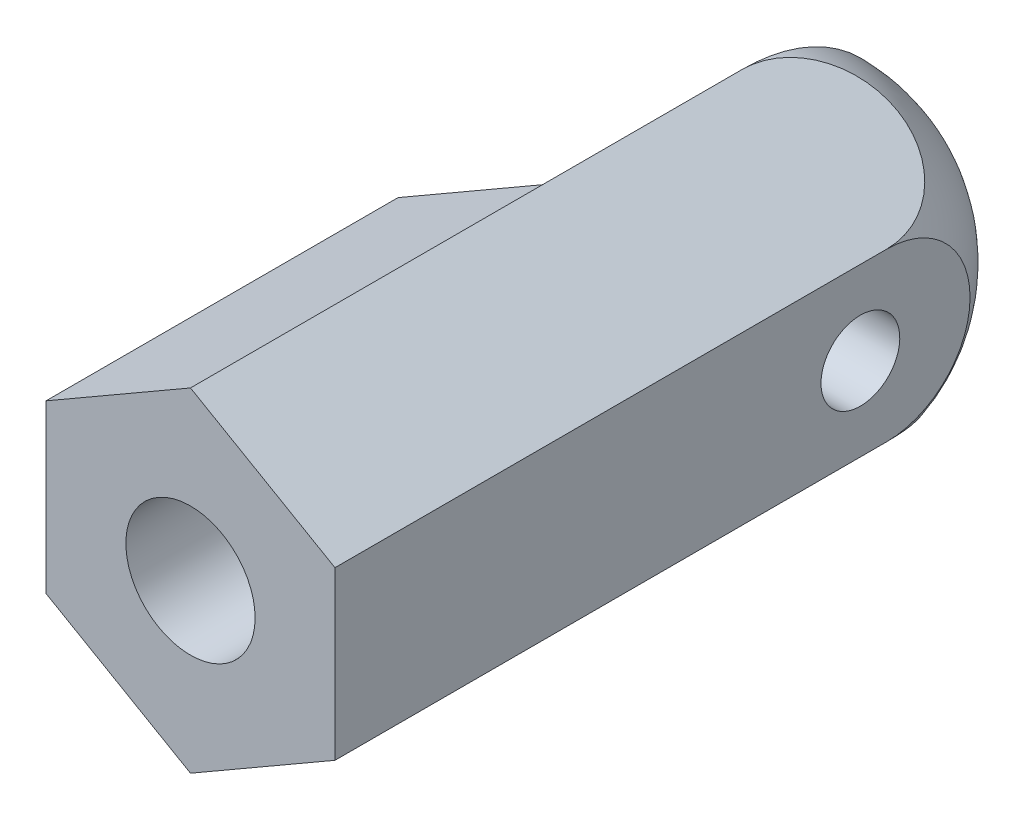
ISO-10303-21;
HEADER;
FILE_DESCRIPTION(('STEP AP214'),'2;1');
FILE_NAME('part.step','',(''),(''),'','','');
FILE_SCHEMA(('AUTOMOTIVE_DESIGN { 1 0 10303 214 1 1 1 1 }'));
ENDSEC;
DATA;
#1=APPLICATION_CONTEXT('core data for automotive mechanical design processes');
#2=APPLICATION_PROTOCOL_DEFINITION('international standard','automotive_design',2000,#1);
#3=PRODUCT_CONTEXT('',#1,'mechanical');
#4=PRODUCT('Part','Part','',(#3));
#5=PRODUCT_RELATED_PRODUCT_CATEGORY('part','',(#4));
#6=PRODUCT_DEFINITION_FORMATION('','',#4);
#7=PRODUCT_DEFINITION_CONTEXT('part definition',#1,'design');
#8=PRODUCT_DEFINITION('design','',#6,#7);
#9=PRODUCT_DEFINITION_SHAPE('','',#8);
#10=(LENGTH_UNIT() NAMED_UNIT(*) SI_UNIT(.MILLI.,.METRE.));
#11=(NAMED_UNIT(*) PLANE_ANGLE_UNIT() SI_UNIT($,.RADIAN.));
#12=(NAMED_UNIT(*) SI_UNIT($,.STERADIAN.) SOLID_ANGLE_UNIT());
#13=UNCERTAINTY_MEASURE_WITH_UNIT(LENGTH_MEASURE(1.E-05),#10,'distance_accuracy_value','');
#14=(GEOMETRIC_REPRESENTATION_CONTEXT(3) GLOBAL_UNCERTAINTY_ASSIGNED_CONTEXT((#13)) GLOBAL_UNIT_ASSIGNED_CONTEXT((#10,
#11,#12)) REPRESENTATION_CONTEXT('',''));
#15=CARTESIAN_POINT('',(0.,0.,0.));
#16=DIRECTION('',(0.,0.,1.));
#17=DIRECTION('',(1.,0.,0.));
#18=AXIS2_PLACEMENT_3D('',#15,#16,#17);
#19=CARTESIAN_POINT('',(2.75,1.58771324027147,-15.));
#20=DIRECTION('',(0.5,0.866025403784439,0.));
#21=DIRECTION('',(-0.866025403784439,0.5,0.));
#22=AXIS2_PLACEMENT_3D('',#19,#20,#21);
#23=PLANE('',#22);
#24=DIRECTION('',(0.,0.,1.));
#25=VECTOR('',#24,1.);
#26=CARTESIAN_POINT('',(2.75,1.58771324027147,-15.));
#27=LINE('',#26,#25);
#28=CARTESIAN_POINT('',(2.75,1.58771324027147,-10.5));
#29=VERTEX_POINT('',#28);
#30=CARTESIAN_POINT('',(2.75,1.58771324027147,0.));
#31=VERTEX_POINT('',#30);
#32=EDGE_CURVE('E43',#29,#31,#27,.T.);
#33=ORIENTED_EDGE('',*,*,#32,.F.);
#34=CARTESIAN_POINT('',(1.375,2.38156986040721,-10.5));
#35=DIRECTION('',(0.5,0.866025403784439,0.));
#36=DIRECTION('',(-0.866025403784439,0.5,0.));
#37=AXIS2_PLACEMENT_3D('',#34,#35,#36);
#38=CIRCLE('',#37,1.58771324027147);
#39=CARTESIAN_POINT('',(0.,3.17542648054294,-10.5));
#40=VERTEX_POINT('',#39);
#41=EDGE_CURVE('E125',#29,#40,#38,.T.);
#42=ORIENTED_EDGE('',*,*,#41,.T.);
#43=DIRECTION('',(0.,0.,1.));
#44=VECTOR('',#43,1.);
#45=CARTESIAN_POINT('',(0.,3.17542648054294,-15.));
#46=LINE('',#45,#44);
#47=CARTESIAN_POINT('',(0.,3.17542648054294,-6.7));
#48=VERTEX_POINT('',#47);
#49=EDGE_CURVE('E109',#40,#48,#46,.T.);
#50=ORIENTED_EDGE('',*,*,#49,.T.);
#51=CARTESIAN_POINT('',(0.,3.17542648054294,0.));
#52=VERTEX_POINT('',#51);
#53=EDGE_CURVE('E117',#48,#52,#46,.T.);
#54=ORIENTED_EDGE('',*,*,#53,.T.);
#55=DIRECTION('',(-0.866025403784439,0.5,0.));
#56=VECTOR('',#55,1.);
#57=CARTESIAN_POINT('',(2.75,1.58771324027147,0.));
#58=LINE('',#57,#56);
#59=EDGE_CURVE('E152',#31,#52,#58,.T.);
#60=ORIENTED_EDGE('',*,*,#59,.F.);
#61=EDGE_LOOP('',(#33,#42,#50,#54,#60));
#62=FACE_BOUND('',#61,.T.);
#63=ADVANCED_FACE('F36',(#62),#23,.T.);
#64=CARTESIAN_POINT('',(2.75,-1.58771324027147,-15.));
#65=DIRECTION('',(1.,0.,0.));
#66=DIRECTION('',(0.,1.,0.));
#67=AXIS2_PLACEMENT_3D('',#64,#65,#66);
#68=PLANE('',#67);
#69=CARTESIAN_POINT('',(2.75,0.,-10.));
#70=DIRECTION('',(1.,0.,0.));
#71=DIRECTION('',(0.,1.,0.));
#72=AXIS2_PLACEMENT_3D('',#69,#70,#71);
#73=CIRCLE('',#72,0.75);
#74=CARTESIAN_POINT('',(2.75,0.750000000000001,-10.));
#75=VERTEX_POINT('',#74);
#76=EDGE_CURVE('E137',#75,#75,#73,.T.);
#77=ORIENTED_EDGE('',*,*,#76,.F.);
#78=EDGE_LOOP('',(#77));
#79=FACE_BOUND('',#78,.T.);
#80=DIRECTION('',(0.,0.,1.));
#81=VECTOR('',#80,1.);
#82=CARTESIAN_POINT('',(2.75,-1.58771324027147,-15.));
#83=LINE('',#82,#81);
#84=CARTESIAN_POINT('',(2.75,-1.58771324027147,-10.5));
#85=VERTEX_POINT('',#84);
#86=CARTESIAN_POINT('',(2.75,-1.58771324027147,0.));
#87=VERTEX_POINT('',#86);
#88=EDGE_CURVE('E57',#85,#87,#83,.T.);
#89=ORIENTED_EDGE('',*,*,#88,.F.);
#90=CARTESIAN_POINT('',(2.75,0.,-10.5));
#91=DIRECTION('',(1.,0.,0.));
#92=DIRECTION('',(0.,1.,0.));
#93=AXIS2_PLACEMENT_3D('',#90,#91,#92);
#94=CIRCLE('',#93,1.58771324027147);
#95=EDGE_CURVE('E145',#85,#29,#94,.T.);
#96=ORIENTED_EDGE('',*,*,#95,.T.);
#97=ORIENTED_EDGE('',*,*,#32,.T.);
#98=DIRECTION('',(0.,1.,0.));
#99=VECTOR('',#98,1.);
#100=CARTESIAN_POINT('',(2.75,-1.58771324027147,0.));
#101=LINE('',#100,#99);
#102=EDGE_CURVE('E123',#87,#31,#101,.T.);
#103=ORIENTED_EDGE('',*,*,#102,.F.);
#104=EDGE_LOOP('',(#89,#96,#97,#103));
#105=FACE_BOUND('',#104,.T.);
#106=ADVANCED_FACE('F189',(#79,#105),#68,.T.);
#107=CARTESIAN_POINT('',(0.,-3.17542648054294,-15.));
#108=DIRECTION('',(0.5,-0.866025403784438,0.));
#109=DIRECTION('',(0.866025403784439,0.5,0.));
#110=AXIS2_PLACEMENT_3D('',#107,#108,#109);
#111=PLANE('',#110);
#112=DIRECTION('',(0.,0.,1.));
#113=VECTOR('',#112,1.);
#114=CARTESIAN_POINT('',(0.,-3.17542648054294,-15.));
#115=LINE('',#114,#113);
#116=CARTESIAN_POINT('',(0.,-3.17542648054294,-10.5));
#117=VERTEX_POINT('',#116);
#118=CARTESIAN_POINT('',(0.,-3.17542648054294,-6.7));
#119=VERTEX_POINT('',#118);
#120=EDGE_CURVE('E112',#117,#119,#115,.T.);
#121=ORIENTED_EDGE('',*,*,#120,.F.);
#122=CARTESIAN_POINT('',(1.375,-2.3815698604072,-10.5));
#123=DIRECTION('',(0.5,-0.866025403784438,0.));
#124=DIRECTION('',(0.866025403784439,0.5,0.));
#125=AXIS2_PLACEMENT_3D('',#122,#123,#124);
#126=CIRCLE('',#125,1.58771324027147);
#127=EDGE_CURVE('E143',#117,#85,#126,.T.);
#128=ORIENTED_EDGE('',*,*,#127,.T.);
#129=ORIENTED_EDGE('',*,*,#88,.T.);
#130=DIRECTION('',(0.866025403784439,0.5,0.));
#131=VECTOR('',#130,1.);
#132=CARTESIAN_POINT('',(0.,-3.17542648054294,0.));
#133=LINE('',#132,#131);
#134=CARTESIAN_POINT('',(0.,-3.17542648054294,0.));
#135=VERTEX_POINT('',#134);
#136=EDGE_CURVE('E163',#135,#87,#133,.T.);
#137=ORIENTED_EDGE('',*,*,#136,.F.);
#138=EDGE_CURVE('E169',#119,#135,#115,.T.);
#139=ORIENTED_EDGE('',*,*,#138,.F.);
#140=EDGE_LOOP('',(#121,#128,#129,#137,#139));
#141=FACE_BOUND('',#140,.T.);
#142=ADVANCED_FACE('F177',(#141),#111,.T.);
#143=CARTESIAN_POINT('',(-2.75,-1.58771324027147,-15.));
#144=DIRECTION('',(-0.5,-0.866025403784438,0.));
#145=DIRECTION('',(0.866025403784439,-0.5,0.));
#146=AXIS2_PLACEMENT_3D('',#143,#144,#145);
#147=PLANE('',#146);
#148=DIRECTION('',(-0.866025403784439,0.5,0.));
#149=VECTOR('',#148,1.);
#150=CARTESIAN_POINT('',(-2.75,-1.58771324027147,-6.7));
#151=LINE('',#150,#149);
#152=CARTESIAN_POINT('',(-2.75,-1.58771324027147,-6.7));
#153=VERTEX_POINT('',#152);
#154=EDGE_CURVE('E134',#119,#153,#151,.T.);
#155=ORIENTED_EDGE('',*,*,#154,.F.);
#156=ORIENTED_EDGE('',*,*,#138,.T.);
#157=DIRECTION('',(0.866025403784439,-0.5,0.));
#158=VECTOR('',#157,1.);
#159=CARTESIAN_POINT('',(-2.75,-1.58771324027147,0.));
#160=LINE('',#159,#158);
#161=CARTESIAN_POINT('',(-2.75,-1.58771324027147,0.));
#162=VERTEX_POINT('',#161);
#163=EDGE_CURVE('E160',#162,#135,#160,.T.);
#164=ORIENTED_EDGE('',*,*,#163,.F.);
#165=DIRECTION('',(0.,0.,1.));
#166=VECTOR('',#165,1.);
#167=CARTESIAN_POINT('',(-2.75,-1.58771324027147,-15.));
#168=LINE('',#167,#166);
#169=EDGE_CURVE('E127',#153,#162,#168,.T.);
#170=ORIENTED_EDGE('',*,*,#169,.F.);
#171=EDGE_LOOP('',(#155,#156,#164,#170));
#172=FACE_BOUND('',#171,.T.);
#173=ADVANCED_FACE('F176',(#172),#147,.T.);
#174=CARTESIAN_POINT('',(-2.75,1.58771324027147,-15.));
#175=DIRECTION('',(-1.,0.,0.));
#176=DIRECTION('',(0.,0.,1.));
#177=AXIS2_PLACEMENT_3D('',#174,#175,#176);
#178=PLANE('',#177);
#179=DIRECTION('',(0.,1.,0.));
#180=VECTOR('',#179,1.);
#181=CARTESIAN_POINT('',(-2.75,-3.17542648054294,-6.7));
#182=LINE('',#181,#180);
#183=CARTESIAN_POINT('',(-2.75,1.58771324027147,-6.7));
#184=VERTEX_POINT('',#183);
#185=EDGE_CURVE('E100',#153,#184,#182,.T.);
#186=ORIENTED_EDGE('',*,*,#185,.F.);
#187=ORIENTED_EDGE('',*,*,#169,.T.);
#188=DIRECTION('',(0.,-1.,0.));
#189=VECTOR('',#188,1.);
#190=CARTESIAN_POINT('',(-2.75,1.58771324027147,0.));
#191=LINE('',#190,#189);
#192=CARTESIAN_POINT('',(-2.75,1.58771324027147,0.));
#193=VERTEX_POINT('',#192);
#194=EDGE_CURVE('E157',#193,#162,#191,.T.);
#195=ORIENTED_EDGE('',*,*,#194,.F.);
#196=DIRECTION('',(0.,0.,1.));
#197=VECTOR('',#196,1.);
#198=CARTESIAN_POINT('',(-2.75,1.58771324027147,-15.));
#199=LINE('',#198,#197);
#200=EDGE_CURVE('E126',#184,#193,#199,.T.);
#201=ORIENTED_EDGE('',*,*,#200,.F.);
#202=EDGE_LOOP('',(#186,#187,#195,#201));
#203=FACE_BOUND('',#202,.T.);
#204=ADVANCED_FACE('F180',(#203),#178,.T.);
#205=CARTESIAN_POINT('',(0.,3.17542648054294,-15.));
#206=DIRECTION('',(-0.5,0.866025403784439,0.));
#207=DIRECTION('',(-0.866025403784439,-0.5,0.));
#208=AXIS2_PLACEMENT_3D('',#205,#206,#207);
#209=PLANE('',#208);
#210=DIRECTION('',(0.866025403784439,0.5,0.));
#211=VECTOR('',#210,1.);
#212=CARTESIAN_POINT('',(0.,3.17542648054294,-6.7));
#213=LINE('',#212,#211);
#214=EDGE_CURVE('E12',#184,#48,#213,.T.);
#215=ORIENTED_EDGE('',*,*,#214,.F.);
#216=ORIENTED_EDGE('',*,*,#200,.T.);
#217=DIRECTION('',(-0.866025403784439,-0.5,0.));
#218=VECTOR('',#217,1.);
#219=CARTESIAN_POINT('',(0.,3.17542648054294,0.));
#220=LINE('',#219,#218);
#221=EDGE_CURVE('E120',#52,#193,#220,.T.);
#222=ORIENTED_EDGE('',*,*,#221,.F.);
#223=ORIENTED_EDGE('',*,*,#53,.F.);
#224=EDGE_LOOP('',(#215,#216,#222,#223));
#225=FACE_BOUND('',#224,.T.);
#226=ADVANCED_FACE('F118',(#225),#209,.T.);
#227=CARTESIAN_POINT('',(0.,0.,0.));
#228=DIRECTION('',(0.,0.,1.));
#229=DIRECTION('',(1.,0.,0.));
#230=AXIS2_PLACEMENT_3D('',#227,#228,#229);
#231=PLANE('',#230);
#232=CARTESIAN_POINT('',(0.,0.,0.));
#233=DIRECTION('',(0.,0.,1.));
#234=DIRECTION('',(1.,0.,0.));
#235=AXIS2_PLACEMENT_3D('',#232,#233,#234);
#236=CIRCLE('',#235,1.23);
#237=CARTESIAN_POINT('',(1.23,0.,0.));
#238=VERTEX_POINT('',#237);
#239=EDGE_CURVE('E148',#238,#238,#236,.T.);
#240=ORIENTED_EDGE('',*,*,#239,.F.);
#241=EDGE_LOOP('',(#240));
#242=FACE_BOUND('',#241,.T.);
#243=ORIENTED_EDGE('',*,*,#59,.T.);
#244=ORIENTED_EDGE('',*,*,#221,.T.);
#245=ORIENTED_EDGE('',*,*,#194,.T.);
#246=ORIENTED_EDGE('',*,*,#163,.T.);
#247=ORIENTED_EDGE('',*,*,#136,.T.);
#248=ORIENTED_EDGE('',*,*,#102,.T.);
#249=EDGE_LOOP('',(#243,#244,#245,#246,#247,#248));
#250=FACE_BOUND('',#249,.T.);
#251=ADVANCED_FACE('F179',(#242,#250),#231,.T.);
#252=CARTESIAN_POINT('',(0.,0.,-6.));
#253=DIRECTION('',(0.,0.,1.));
#254=DIRECTION('',(1.,0.,0.));
#255=AXIS2_PLACEMENT_3D('',#252,#253,#254);
#256=CYLINDRICAL_SURFACE('',#255,1.23);
#257=CARTESIAN_POINT('',(0.,0.,-6.));
#258=DIRECTION('',(0.,0.,1.));
#259=DIRECTION('',(1.,0.,0.));
#260=AXIS2_PLACEMENT_3D('',#257,#258,#259);
#261=CIRCLE('',#260,1.23);
#262=CARTESIAN_POINT('',(1.23,0.,-6.));
#263=VERTEX_POINT('',#262);
#264=EDGE_CURVE('E149',#263,#263,#261,.T.);
#265=ORIENTED_EDGE('',*,*,#264,.F.);
#266=EDGE_LOOP('',(#265));
#267=FACE_BOUND('',#266,.T.);
#268=ORIENTED_EDGE('',*,*,#239,.T.);
#269=EDGE_LOOP('',(#268));
#270=FACE_BOUND('',#269,.T.);
#271=ADVANCED_FACE('F203',(#267,#270),#256,.F.);
#272=CARTESIAN_POINT('',(0.,0.,-6.));
#273=DIRECTION('',(0.,0.,1.));
#274=DIRECTION('',(1.,0.,0.));
#275=AXIS2_PLACEMENT_3D('',#272,#273,#274);
#276=PLANE('',#275);
#277=ORIENTED_EDGE('',*,*,#264,.T.);
#278=EDGE_LOOP('',(#277));
#279=FACE_BOUND('',#278,.T.);
#280=ADVANCED_FACE('F207',(#279),#276,.T.);
#281=CARTESIAN_POINT('',(0.,0.,-10.5));
#282=DIRECTION('',(0.,0.,1.));
#283=DIRECTION('',(0.,1.,0.));
#284=AXIS2_PLACEMENT_3D('',#281,#282,#283);
#285=SPHERICAL_SURFACE('',#284,3.17542648054294);
#286=CARTESIAN_POINT('',(0.,0.,-10.5));
#287=DIRECTION('',(1.,0.,0.));
#288=DIRECTION('',(0.,0.,-1.));
#289=AXIS2_PLACEMENT_3D('',#286,#287,#288);
#290=CIRCLE('',#289,3.17542648054294);
#291=EDGE_CURVE('E131',#40,#117,#290,.F.);
#292=ORIENTED_EDGE('',*,*,#291,.F.);
#293=ORIENTED_EDGE('',*,*,#41,.F.);
#294=ORIENTED_EDGE('',*,*,#95,.F.);
#295=ORIENTED_EDGE('',*,*,#127,.F.);
#296=EDGE_LOOP('',(#292,#293,#294,#295));
#297=FACE_BOUND('',#296,.T.);
#298=ADVANCED_FACE('F211',(#297),#285,.T.);
#299=CARTESIAN_POINT('',(-2.75,0.,-10.));
#300=DIRECTION('',(1.,0.,0.));
#301=DIRECTION('',(0.,1.,0.));
#302=AXIS2_PLACEMENT_3D('',#299,#300,#301);
#303=CYLINDRICAL_SURFACE('',#302,0.75);
#304=CARTESIAN_POINT('',(0.,0.,-10.));
#305=DIRECTION('',(1.,0.,0.));
#306=DIRECTION('',(0.,0.,-1.));
#307=AXIS2_PLACEMENT_3D('',#304,#305,#306);
#308=CIRCLE('',#307,0.75);
#309=CARTESIAN_POINT('',(0.,0.,-10.75));
#310=VERTEX_POINT('',#309);
#311=EDGE_CURVE('E114',#310,#310,#308,.F.);
#312=ORIENTED_EDGE('',*,*,#311,.T.);
#313=EDGE_LOOP('',(#312));
#314=FACE_BOUND('',#313,.T.);
#315=ORIENTED_EDGE('',*,*,#76,.T.);
#316=EDGE_LOOP('',(#315));
#317=FACE_BOUND('',#316,.T.);
#318=ADVANCED_FACE('F215',(#314,#317),#303,.F.);
#319=CARTESIAN_POINT('',(0.,-3.17542648054294,-6.7));
#320=DIRECTION('',(1.,0.,0.));
#321=DIRECTION('',(0.,0.,-1.));
#322=AXIS2_PLACEMENT_3D('',#319,#320,#321);
#323=PLANE('',#322);
#324=ORIENTED_EDGE('',*,*,#291,.T.);
#325=ORIENTED_EDGE('',*,*,#120,.T.);
#326=DIRECTION('',(0.,1.,0.));
#327=VECTOR('',#326,1.);
#328=CARTESIAN_POINT('',(0.,-3.17542648054294,-6.7));
#329=LINE('',#328,#327);
#330=EDGE_CURVE('E97',#119,#48,#329,.T.);
#331=ORIENTED_EDGE('',*,*,#330,.T.);
#332=ORIENTED_EDGE('',*,*,#49,.F.);
#333=EDGE_LOOP('',(#324,#325,#331,#332));
#334=FACE_BOUND('',#333,.T.);
#335=ORIENTED_EDGE('',*,*,#311,.F.);
#336=EDGE_LOOP('',(#335));
#337=FACE_BOUND('',#336,.T.);
#338=ADVANCED_FACE('F106',(#334,#337),#323,.F.);
#339=CARTESIAN_POINT('',(-2.75,-3.17542648054294,-6.7));
#340=DIRECTION('',(0.,0.,1.));
#341=DIRECTION('',(1.,0.,0.));
#342=AXIS2_PLACEMENT_3D('',#339,#340,#341);
#343=PLANE('',#342);
#344=ORIENTED_EDGE('',*,*,#154,.T.);
#345=ORIENTED_EDGE('',*,*,#185,.T.);
#346=ORIENTED_EDGE('',*,*,#214,.T.);
#347=ORIENTED_EDGE('',*,*,#330,.F.);
#348=EDGE_LOOP('',(#344,#345,#346,#347));
#349=FACE_BOUND('',#348,.T.);
#350=ADVANCED_FACE('F96',(#349),#343,.F.);
#351=CLOSED_SHELL('',(#63,#106,#142,#173,#204,#226,#251,#271,#280,#298,#318,#338,#350));
#352=MANIFOLD_SOLID_BREP('B2',#351);
#353=ADVANCED_BREP_SHAPE_REPRESENTATION('',(#18,#352),#14);
#354=SHAPE_DEFINITION_REPRESENTATION(#9,#353);
ENDSEC;
END-ISO-10303-21;
